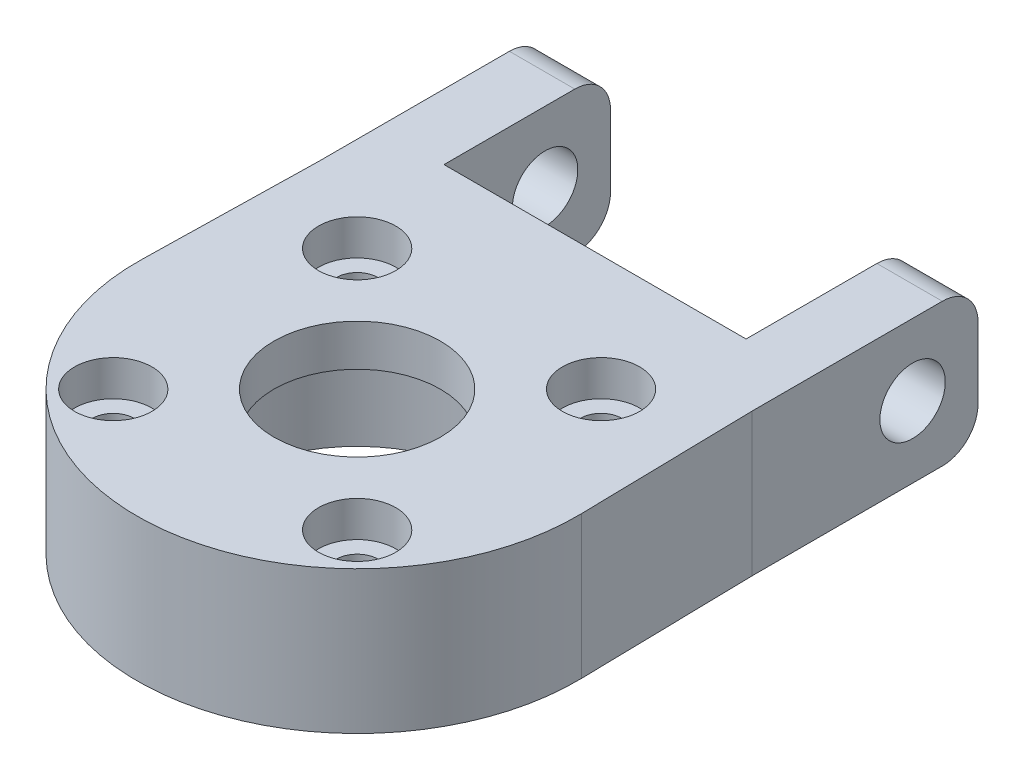
ISO-10303-21;
HEADER;
FILE_DESCRIPTION(('STEP AP214'),'2;1');
FILE_NAME('part.step','',(''),(''),'','','');
FILE_SCHEMA(('AUTOMOTIVE_DESIGN { 1 0 10303 214 1 1 1 1 }'));
ENDSEC;
DATA;
#1=APPLICATION_CONTEXT('core data for automotive mechanical design processes');
#2=APPLICATION_PROTOCOL_DEFINITION('international standard','automotive_design',2000,#1);
#3=PRODUCT_CONTEXT('',#1,'mechanical');
#4=PRODUCT('Part','Part','',(#3));
#5=PRODUCT_RELATED_PRODUCT_CATEGORY('part','',(#4));
#6=PRODUCT_DEFINITION_FORMATION('','',#4);
#7=PRODUCT_DEFINITION_CONTEXT('part definition',#1,'design');
#8=PRODUCT_DEFINITION('design','',#6,#7);
#9=PRODUCT_DEFINITION_SHAPE('','',#8);
#10=(LENGTH_UNIT() NAMED_UNIT(*) SI_UNIT(.MILLI.,.METRE.));
#11=(NAMED_UNIT(*) PLANE_ANGLE_UNIT() SI_UNIT($,.RADIAN.));
#12=(NAMED_UNIT(*) SI_UNIT($,.STERADIAN.) SOLID_ANGLE_UNIT());
#13=UNCERTAINTY_MEASURE_WITH_UNIT(LENGTH_MEASURE(1.E-05),#10,'distance_accuracy_value','');
#14=(GEOMETRIC_REPRESENTATION_CONTEXT(3) GLOBAL_UNCERTAINTY_ASSIGNED_CONTEXT((#13)) GLOBAL_UNIT_ASSIGNED_CONTEXT((#10,
#11,#12)) REPRESENTATION_CONTEXT('',''));
#15=CARTESIAN_POINT('',(0.,0.,0.));
#16=DIRECTION('',(0.,0.,1.));
#17=DIRECTION('',(1.,0.,0.));
#18=AXIS2_PLACEMENT_3D('',#15,#16,#17);
#19=CARTESIAN_POINT('',(-18.2,12.,-20.));
#20=DIRECTION('',(0.,0.,1.));
#21=DIRECTION('',(1.,0.,0.));
#22=AXIS2_PLACEMENT_3D('',#19,#20,#21);
#23=PLANE('',#22);
#24=DIRECTION('',(0.,-1.,0.));
#25=VECTOR('',#24,1.);
#26=CARTESIAN_POINT('',(-12.7,0.,-20.));
#27=LINE('',#26,#25);
#28=CARTESIAN_POINT('',(-12.7,12.,-20.));
#29=VERTEX_POINT('',#28);
#30=CARTESIAN_POINT('',(-12.7,0.,-20.));
#31=VERTEX_POINT('',#30);
#32=EDGE_CURVE('E137',#29,#31,#27,.T.);
#33=ORIENTED_EDGE('',*,*,#32,.F.);
#34=DIRECTION('',(-1.,0.,0.));
#35=VECTOR('',#34,1.);
#36=CARTESIAN_POINT('',(-18.2,12.,-20.));
#37=LINE('',#36,#35);
#38=CARTESIAN_POINT('',(12.7,12.,-20.));
#39=VERTEX_POINT('',#38);
#40=EDGE_CURVE('E147',#39,#29,#37,.T.);
#41=ORIENTED_EDGE('',*,*,#40,.F.);
#42=DIRECTION('',(0.,1.,0.));
#43=VECTOR('',#42,1.);
#44=CARTESIAN_POINT('',(12.7,0.,-20.));
#45=LINE('',#44,#43);
#46=CARTESIAN_POINT('',(12.7,0.,-20.));
#47=VERTEX_POINT('',#46);
#48=EDGE_CURVE('E141',#47,#39,#45,.T.);
#49=ORIENTED_EDGE('',*,*,#48,.F.);
#50=DIRECTION('',(-1.,0.,0.));
#51=VECTOR('',#50,1.);
#52=CARTESIAN_POINT('',(-18.2,0.,-20.));
#53=LINE('',#52,#51);
#54=EDGE_CURVE('E150',#47,#31,#53,.T.);
#55=ORIENTED_EDGE('',*,*,#54,.T.);
#56=EDGE_LOOP('',(#33,#41,#49,#55));
#57=FACE_BOUND('',#56,.T.);
#58=ADVANCED_FACE('F32',(#57),#23,.F.);
#59=CARTESIAN_POINT('',(10.2530483272049,12.,10.253048327205));
#60=DIRECTION('',(0.,-1.,0.));
#61=DIRECTION('',(0.,0.,-1.));
#62=AXIS2_PLACEMENT_3D('',#59,#60,#61);
#63=CYLINDRICAL_SURFACE('',#62,1.75);
#64=CARTESIAN_POINT('',(10.2530483272049,0.,10.253048327205));
#65=DIRECTION('',(0.,-1.,0.));
#66=DIRECTION('',(0.,0.,-1.));
#67=AXIS2_PLACEMENT_3D('',#64,#65,#66);
#68=CIRCLE('',#67,1.75);
#69=CARTESIAN_POINT('',(10.2530483272049,0.,8.50304832720495));
#70=VERTEX_POINT('',#69);
#71=EDGE_CURVE('E306',#70,#70,#68,.T.);
#72=ORIENTED_EDGE('',*,*,#71,.T.);
#73=EDGE_LOOP('',(#72));
#74=FACE_BOUND('',#73,.T.);
#75=CARTESIAN_POINT('',(10.2530483272049,9.,10.253048327205));
#76=DIRECTION('',(0.,1.,0.));
#77=DIRECTION('',(0.,0.,1.));
#78=AXIS2_PLACEMENT_3D('',#75,#76,#77);
#79=CIRCLE('',#78,1.75);
#80=CARTESIAN_POINT('',(10.2530483272049,9.,12.003048327205));
#81=VERTEX_POINT('',#80);
#82=EDGE_CURVE('E213',#81,#81,#79,.F.);
#83=ORIENTED_EDGE('',*,*,#82,.F.);
#84=EDGE_LOOP('',(#83));
#85=FACE_BOUND('',#84,.T.);
#86=ADVANCED_FACE('F362',(#74,#85),#63,.F.);
#87=CARTESIAN_POINT('',(-10.253048327205,12.,10.2530483272044));
#88=DIRECTION('',(0.,-1.,0.));
#89=DIRECTION('',(0.,0.,-1.));
#90=AXIS2_PLACEMENT_3D('',#87,#88,#89);
#91=CYLINDRICAL_SURFACE('',#90,1.75000000000061);
#92=CARTESIAN_POINT('',(-10.253048327205,0.,10.2530483272044));
#93=DIRECTION('',(0.,-1.,0.));
#94=DIRECTION('',(0.,0.,-1.));
#95=AXIS2_PLACEMENT_3D('',#92,#93,#94);
#96=CIRCLE('',#95,1.75000000000061);
#97=CARTESIAN_POINT('',(-10.253048327205,0.,8.50304832720374));
#98=VERTEX_POINT('',#97);
#99=EDGE_CURVE('E204',#98,#98,#96,.T.);
#100=ORIENTED_EDGE('',*,*,#99,.T.);
#101=EDGE_LOOP('',(#100));
#102=FACE_BOUND('',#101,.T.);
#103=CARTESIAN_POINT('',(-10.253048327205,9.,10.2530483272044));
#104=DIRECTION('',(0.,1.,0.));
#105=DIRECTION('',(0.,0.,1.));
#106=AXIS2_PLACEMENT_3D('',#103,#104,#105);
#107=CIRCLE('',#106,1.75000000000061);
#108=CARTESIAN_POINT('',(-10.253048327205,9.,12.003048327205));
#109=VERTEX_POINT('',#108);
#110=EDGE_CURVE('E209',#109,#109,#107,.F.);
#111=ORIENTED_EDGE('',*,*,#110,.F.);
#112=EDGE_LOOP('',(#111));
#113=FACE_BOUND('',#112,.T.);
#114=ADVANCED_FACE('F367',(#102,#113),#91,.F.);
#115=CARTESIAN_POINT('',(10.2530483272055,12.,-10.2530483272049));
#116=DIRECTION('',(0.,-1.,0.));
#117=DIRECTION('',(0.,0.,-1.));
#118=AXIS2_PLACEMENT_3D('',#115,#116,#117);
#119=CYLINDRICAL_SURFACE('',#118,1.74999999999986);
#120=CARTESIAN_POINT('',(10.2530483272055,0.,-10.2530483272049));
#121=DIRECTION('',(0.,-1.,0.));
#122=DIRECTION('',(0.,0.,-1.));
#123=AXIS2_PLACEMENT_3D('',#120,#121,#122);
#124=CIRCLE('',#123,1.74999999999986);
#125=CARTESIAN_POINT('',(10.2530483272055,0.,-12.0030483272048));
#126=VERTEX_POINT('',#125);
#127=EDGE_CURVE('E303',#126,#126,#124,.T.);
#128=ORIENTED_EDGE('',*,*,#127,.T.);
#129=EDGE_LOOP('',(#128));
#130=FACE_BOUND('',#129,.T.);
#131=CARTESIAN_POINT('',(10.2530483272055,9.,-10.2530483272049));
#132=DIRECTION('',(0.,1.,0.));
#133=DIRECTION('',(0.,0.,1.));
#134=AXIS2_PLACEMENT_3D('',#131,#132,#133);
#135=CIRCLE('',#134,1.74999999999986);
#136=CARTESIAN_POINT('',(10.2530483272055,9.,-8.50304832720506));
#137=VERTEX_POINT('',#136);
#138=EDGE_CURVE('E206',#137,#137,#135,.F.);
#139=ORIENTED_EDGE('',*,*,#138,.F.);
#140=EDGE_LOOP('',(#139));
#141=FACE_BOUND('',#140,.T.);
#142=ADVANCED_FACE('F438',(#130,#141),#119,.F.);
#143=CARTESIAN_POINT('',(-10.2530483272044,12.,-10.2530483272055));
#144=DIRECTION('',(0.,-1.,0.));
#145=DIRECTION('',(0.,0.,-1.));
#146=AXIS2_PLACEMENT_3D('',#143,#144,#145);
#147=CYLINDRICAL_SURFACE('',#146,1.75000000000042);
#148=CARTESIAN_POINT('',(-10.2530483272044,0.,-10.2530483272055));
#149=DIRECTION('',(0.,-1.,0.));
#150=DIRECTION('',(0.,0.,-1.));
#151=AXIS2_PLACEMENT_3D('',#148,#149,#150);
#152=CIRCLE('',#151,1.75000000000042);
#153=CARTESIAN_POINT('',(-10.2530483272044,0.,-12.0030483272059));
#154=VERTEX_POINT('',#153);
#155=EDGE_CURVE('E307',#154,#154,#152,.T.);
#156=ORIENTED_EDGE('',*,*,#155,.T.);
#157=EDGE_LOOP('',(#156));
#158=FACE_BOUND('',#157,.T.);
#159=CARTESIAN_POINT('',(-10.2530483272044,9.,-10.2530483272055));
#160=DIRECTION('',(0.,1.,0.));
#161=DIRECTION('',(0.,0.,1.));
#162=AXIS2_PLACEMENT_3D('',#159,#160,#161);
#163=CIRCLE('',#162,1.75000000000042);
#164=CARTESIAN_POINT('',(-10.2530483272044,9.,-8.50304832720511));
#165=VERTEX_POINT('',#164);
#166=EDGE_CURVE('E201',#165,#165,#163,.F.);
#167=ORIENTED_EDGE('',*,*,#166,.F.);
#168=EDGE_LOOP('',(#167));
#169=FACE_BOUND('',#168,.T.);
#170=ADVANCED_FACE('F441',(#158,#169),#147,.F.);
#171=CARTESIAN_POINT('',(0.,12.,0.));
#172=DIRECTION('',(0.,-1.,0.));
#173=DIRECTION('',(0.,0.,-1.));
#174=AXIS2_PLACEMENT_3D('',#171,#172,#173);
#175=CYLINDRICAL_SURFACE('',#174,7.);
#176=CARTESIAN_POINT('',(0.,12.,0.));
#177=DIRECTION('',(0.,1.,0.));
#178=DIRECTION('',(0.,0.,1.));
#179=AXIS2_PLACEMENT_3D('',#176,#177,#178);
#180=CIRCLE('',#179,7.);
#181=CARTESIAN_POINT('',(0.,12.,7.));
#182=VERTEX_POINT('',#181);
#183=EDGE_CURVE('E174',#182,#182,#180,.T.);
#184=ORIENTED_EDGE('',*,*,#183,.T.);
#185=EDGE_LOOP('',(#184));
#186=FACE_BOUND('',#185,.T.);
#187=CARTESIAN_POINT('',(0.,8.5,0.));
#188=DIRECTION('',(0.,-1.,0.));
#189=DIRECTION('',(0.,0.,-1.));
#190=AXIS2_PLACEMENT_3D('',#187,#188,#189);
#191=CIRCLE('',#190,7.);
#192=CARTESIAN_POINT('',(0.,8.5,-7.));
#193=VERTEX_POINT('',#192);
#194=EDGE_CURVE('E197',#193,#193,#191,.T.);
#195=ORIENTED_EDGE('',*,*,#194,.T.);
#196=EDGE_LOOP('',(#195));
#197=FACE_BOUND('',#196,.T.);
#198=ADVANCED_FACE('F445',(#186,#197),#175,.F.);
#199=CARTESIAN_POINT('',(0.,12.,0.));
#200=DIRECTION('',(0.,1.,0.));
#201=DIRECTION('',(0.,0.,1.));
#202=AXIS2_PLACEMENT_3D('',#199,#200,#201);
#203=PLANE('',#202);
#204=CARTESIAN_POINT('',(10.2530483272055,12.,-10.2530483272049));
#205=DIRECTION('',(0.,1.,0.));
#206=DIRECTION('',(0.,0.,1.));
#207=AXIS2_PLACEMENT_3D('',#204,#205,#206);
#208=CIRCLE('',#207,3.25);
#209=CARTESIAN_POINT('',(10.2530483272055,12.,-7.00304832720494));
#210=VERTEX_POINT('',#209);
#211=EDGE_CURVE('E285',#210,#210,#208,.T.);
#212=ORIENTED_EDGE('',*,*,#211,.F.);
#213=EDGE_LOOP('',(#212));
#214=FACE_BOUND('',#213,.T.);
#215=CARTESIAN_POINT('',(10.2530483272049,12.,10.2530483272049));
#216=DIRECTION('',(0.,1.,0.));
#217=DIRECTION('',(0.,0.,1.));
#218=AXIS2_PLACEMENT_3D('',#215,#216,#217);
#219=CIRCLE('',#218,3.25);
#220=CARTESIAN_POINT('',(10.2530483272049,12.,13.5030483272049));
#221=VERTEX_POINT('',#220);
#222=EDGE_CURVE('E291',#221,#221,#219,.T.);
#223=ORIENTED_EDGE('',*,*,#222,.F.);
#224=EDGE_LOOP('',(#223));
#225=FACE_BOUND('',#224,.T.);
#226=CARTESIAN_POINT('',(-10.2530483272049,12.,10.2530483272044));
#227=DIRECTION('',(0.,1.,0.));
#228=DIRECTION('',(0.,0.,1.));
#229=AXIS2_PLACEMENT_3D('',#226,#227,#228);
#230=CIRCLE('',#229,3.25);
#231=CARTESIAN_POINT('',(-10.2530483272049,12.,13.5030483272044));
#232=VERTEX_POINT('',#231);
#233=EDGE_CURVE('E282',#232,#232,#230,.T.);
#234=ORIENTED_EDGE('',*,*,#233,.F.);
#235=EDGE_LOOP('',(#234));
#236=FACE_BOUND('',#235,.T.);
#237=CARTESIAN_POINT('',(-10.2530483272044,12.,-10.2530483272055));
#238=DIRECTION('',(0.,1.,0.));
#239=DIRECTION('',(0.,0.,1.));
#240=AXIS2_PLACEMENT_3D('',#237,#238,#239);
#241=CIRCLE('',#240,3.25);
#242=CARTESIAN_POINT('',(-10.2530483272044,12.,-7.00304832720552));
#243=VERTEX_POINT('',#242);
#244=EDGE_CURVE('E216',#243,#243,#241,.T.);
#245=ORIENTED_EDGE('',*,*,#244,.F.);
#246=EDGE_LOOP('',(#245));
#247=FACE_BOUND('',#246,.T.);
#248=DIRECTION('',(0.,0.,-1.));
#249=VECTOR('',#248,1.);
#250=CARTESIAN_POINT('',(18.2,12.,-20.));
#251=LINE('',#250,#249);
#252=CARTESIAN_POINT('',(18.2,12.,-15.));
#253=VERTEX_POINT('',#252);
#254=CARTESIAN_POINT('',(18.2,12.,-31.));
#255=VERTEX_POINT('',#254);
#256=EDGE_CURVE('E160',#253,#255,#251,.T.);
#257=ORIENTED_EDGE('',*,*,#256,.T.);
#258=DIRECTION('',(1.,0.,0.));
#259=VECTOR('',#258,1.);
#260=CARTESIAN_POINT('',(12.7,12.,-31.));
#261=LINE('',#260,#259);
#262=CARTESIAN_POINT('',(12.7,12.,-31.));
#263=VERTEX_POINT('',#262);
#264=EDGE_CURVE('E241',#255,#263,#261,.F.);
#265=ORIENTED_EDGE('',*,*,#264,.T.);
#266=DIRECTION('',(0.,0.,1.));
#267=VECTOR('',#266,1.);
#268=CARTESIAN_POINT('',(12.7,12.,-34.));
#269=LINE('',#268,#267);
#270=EDGE_CURVE('E158',#263,#39,#269,.T.);
#271=ORIENTED_EDGE('',*,*,#270,.T.);
#272=ORIENTED_EDGE('',*,*,#40,.T.);
#273=DIRECTION('',(0.,0.,1.));
#274=VECTOR('',#273,1.);
#275=CARTESIAN_POINT('',(-12.7,12.,-34.));
#276=LINE('',#275,#274);
#277=CARTESIAN_POINT('',(-12.7,12.,-31.));
#278=VERTEX_POINT('',#277);
#279=EDGE_CURVE('E134',#278,#29,#276,.T.);
#280=ORIENTED_EDGE('',*,*,#279,.F.);
#281=DIRECTION('',(1.,0.,0.));
#282=VECTOR('',#281,1.);
#283=CARTESIAN_POINT('',(-18.2,12.,-31.));
#284=LINE('',#283,#282);
#285=CARTESIAN_POINT('',(-18.2,12.,-31.));
#286=VERTEX_POINT('',#285);
#287=EDGE_CURVE('E239',#278,#286,#284,.F.);
#288=ORIENTED_EDGE('',*,*,#287,.T.);
#289=DIRECTION('',(0.,0.,1.));
#290=VECTOR('',#289,1.);
#291=CARTESIAN_POINT('',(-18.2,12.,-15.));
#292=LINE('',#291,#290);
#293=CARTESIAN_POINT('',(-18.2,12.,-15.));
#294=VERTEX_POINT('',#293);
#295=EDGE_CURVE('E159',#286,#294,#292,.T.);
#296=ORIENTED_EDGE('',*,*,#295,.T.);
#297=DIRECTION('',(-0.0202487664444169,0.,0.999794972710645));
#298=VECTOR('',#297,1.);
#299=CARTESIAN_POINT('',(-18.2,12.,-15.));
#300=LINE('',#299,#298);
#301=CARTESIAN_POINT('',(-18.4962069951469,12.,-0.37460217922172));
#302=VERTEX_POINT('',#301);
#303=EDGE_CURVE('E162',#294,#302,#300,.T.);
#304=ORIENTED_EDGE('',*,*,#303,.T.);
#305=CARTESIAN_POINT('',(0.,12.,0.));
#306=DIRECTION('',(0.,1.,0.));
#307=DIRECTION('',(0.,0.,1.));
#308=AXIS2_PLACEMENT_3D('',#305,#306,#307);
#309=CIRCLE('',#308,18.5);
#310=CARTESIAN_POINT('',(18.4962069951469,12.,-0.37460217922172));
#311=VERTEX_POINT('',#310);
#312=EDGE_CURVE('E184',#302,#311,#309,.T.);
#313=ORIENTED_EDGE('',*,*,#312,.T.);
#314=DIRECTION('',(-0.0202487664444169,0.,-0.999794972710645));
#315=VECTOR('',#314,1.);
#316=CARTESIAN_POINT('',(18.2,12.,-15.));
#317=LINE('',#316,#315);
#318=EDGE_CURVE('E164',#311,#253,#317,.T.);
#319=ORIENTED_EDGE('',*,*,#318,.T.);
#320=EDGE_LOOP('',(#257,#265,#271,#272,#280,#288,#296,#304,#313,#319));
#321=FACE_BOUND('',#320,.T.);
#322=ORIENTED_EDGE('',*,*,#183,.F.);
#323=EDGE_LOOP('',(#322));
#324=FACE_BOUND('',#323,.T.);
#325=ADVANCED_FACE('F155',(#214,#225,#236,#247,#321,#324),#203,.T.);
#326=CARTESIAN_POINT('',(0.,0.,0.));
#327=DIRECTION('',(0.,1.,0.));
#328=DIRECTION('',(0.,0.,1.));
#329=AXIS2_PLACEMENT_3D('',#326,#327,#328);
#330=PLANE('',#329);
#331=ORIENTED_EDGE('',*,*,#127,.F.);
#332=EDGE_LOOP('',(#331));
#333=FACE_BOUND('',#332,.T.);
#334=ORIENTED_EDGE('',*,*,#155,.F.);
#335=EDGE_LOOP('',(#334));
#336=FACE_BOUND('',#335,.T.);
#337=ORIENTED_EDGE('',*,*,#99,.F.);
#338=EDGE_LOOP('',(#337));
#339=FACE_BOUND('',#338,.T.);
#340=ORIENTED_EDGE('',*,*,#71,.F.);
#341=EDGE_LOOP('',(#340));
#342=FACE_BOUND('',#341,.T.);
#343=CARTESIAN_POINT('',(0.,0.,0.));
#344=DIRECTION('',(0.,-1.,0.));
#345=DIRECTION('',(0.,0.,-1.));
#346=AXIS2_PLACEMENT_3D('',#343,#344,#345);
#347=CIRCLE('',#346,11.075);
#348=CARTESIAN_POINT('',(0.,0.,-11.075));
#349=VERTEX_POINT('',#348);
#350=EDGE_CURVE('E314',#349,#349,#347,.T.);
#351=ORIENTED_EDGE('',*,*,#350,.F.);
#352=EDGE_LOOP('',(#351));
#353=FACE_BOUND('',#352,.T.);
#354=DIRECTION('',(0.,0.,1.));
#355=VECTOR('',#354,1.);
#356=CARTESIAN_POINT('',(12.7,0.,-34.));
#357=LINE('',#356,#355);
#358=CARTESIAN_POINT('',(12.7,0.,-31.));
#359=VERTEX_POINT('',#358);
#360=EDGE_CURVE('E280',#359,#47,#357,.T.);
#361=ORIENTED_EDGE('',*,*,#360,.F.);
#362=DIRECTION('',(-1.,0.,0.));
#363=VECTOR('',#362,1.);
#364=CARTESIAN_POINT('',(0.,0.,-31.));
#365=LINE('',#364,#363);
#366=CARTESIAN_POINT('',(18.2,0.,-31.));
#367=VERTEX_POINT('',#366);
#368=EDGE_CURVE('E233',#359,#367,#365,.F.);
#369=ORIENTED_EDGE('',*,*,#368,.T.);
#370=DIRECTION('',(0.,0.,-1.));
#371=VECTOR('',#370,1.);
#372=CARTESIAN_POINT('',(18.2,0.,-20.));
#373=LINE('',#372,#371);
#374=CARTESIAN_POINT('',(18.2,0.,-15.));
#375=VERTEX_POINT('',#374);
#376=EDGE_CURVE('E176',#375,#367,#373,.T.);
#377=ORIENTED_EDGE('',*,*,#376,.F.);
#378=DIRECTION('',(-0.0202487664444169,0.,-0.999794972710645));
#379=VECTOR('',#378,1.);
#380=CARTESIAN_POINT('',(18.2,0.,-15.));
#381=LINE('',#380,#379);
#382=CARTESIAN_POINT('',(18.4962069951469,0.,-0.37460217922172));
#383=VERTEX_POINT('',#382);
#384=EDGE_CURVE('E173',#383,#375,#381,.T.);
#385=ORIENTED_EDGE('',*,*,#384,.F.);
#386=CARTESIAN_POINT('',(0.,0.,0.));
#387=DIRECTION('',(0.,1.,0.));
#388=DIRECTION('',(0.,0.,1.));
#389=AXIS2_PLACEMENT_3D('',#386,#387,#388);
#390=CIRCLE('',#389,18.5);
#391=CARTESIAN_POINT('',(-18.4962069951469,0.,-0.37460217922172));
#392=VERTEX_POINT('',#391);
#393=EDGE_CURVE('E170',#392,#383,#390,.T.);
#394=ORIENTED_EDGE('',*,*,#393,.F.);
#395=DIRECTION('',(-0.0202487664444169,0.,0.999794972710645));
#396=VECTOR('',#395,1.);
#397=CARTESIAN_POINT('',(-18.2,0.,-15.));
#398=LINE('',#397,#396);
#399=CARTESIAN_POINT('',(-18.2,0.,-15.));
#400=VERTEX_POINT('',#399);
#401=EDGE_CURVE('E182',#400,#392,#398,.T.);
#402=ORIENTED_EDGE('',*,*,#401,.F.);
#403=DIRECTION('',(0.,0.,1.));
#404=VECTOR('',#403,1.);
#405=CARTESIAN_POINT('',(-18.2,0.,-15.));
#406=LINE('',#405,#404);
#407=CARTESIAN_POINT('',(-18.2,0.,-31.));
#408=VERTEX_POINT('',#407);
#409=EDGE_CURVE('E180',#408,#400,#406,.T.);
#410=ORIENTED_EDGE('',*,*,#409,.F.);
#411=DIRECTION('',(-1.,0.,0.));
#412=VECTOR('',#411,1.);
#413=CARTESIAN_POINT('',(0.,0.,-31.));
#414=LINE('',#413,#412);
#415=CARTESIAN_POINT('',(-12.7,0.,-31.));
#416=VERTEX_POINT('',#415);
#417=EDGE_CURVE('E231',#408,#416,#414,.F.);
#418=ORIENTED_EDGE('',*,*,#417,.T.);
#419=DIRECTION('',(0.,0.,1.));
#420=VECTOR('',#419,1.);
#421=CARTESIAN_POINT('',(-12.7,0.,-34.));
#422=LINE('',#421,#420);
#423=EDGE_CURVE('E142',#416,#31,#422,.T.);
#424=ORIENTED_EDGE('',*,*,#423,.T.);
#425=ORIENTED_EDGE('',*,*,#54,.F.);
#426=EDGE_LOOP('',(#361,#369,#377,#385,#394,#402,#410,#418,#424,#425));
#427=FACE_BOUND('',#426,.T.);
#428=ADVANCED_FACE('F262',(#333,#336,#339,#342,#353,#427),#330,.F.);
#429=CARTESIAN_POINT('',(0.,12.,0.));
#430=DIRECTION('',(0.,-1.,0.));
#431=DIRECTION('',(0.,0.,-1.));
#432=AXIS2_PLACEMENT_3D('',#429,#430,#431);
#433=CYLINDRICAL_SURFACE('',#432,18.5);
#434=ORIENTED_EDGE('',*,*,#393,.T.);
#435=DIRECTION('',(0.,-1.,0.));
#436=VECTOR('',#435,1.);
#437=CARTESIAN_POINT('',(18.4962069951469,12.,-0.37460217922172));
#438=LINE('',#437,#436);
#439=EDGE_CURVE('E193',#311,#383,#438,.T.);
#440=ORIENTED_EDGE('',*,*,#439,.F.);
#441=ORIENTED_EDGE('',*,*,#312,.F.);
#442=DIRECTION('',(0.,-1.,0.));
#443=VECTOR('',#442,1.);
#444=CARTESIAN_POINT('',(-18.4962069951469,12.,-0.37460217922172));
#445=LINE('',#444,#443);
#446=EDGE_CURVE('E169',#302,#392,#445,.T.);
#447=ORIENTED_EDGE('',*,*,#446,.T.);
#448=EDGE_LOOP('',(#434,#440,#441,#447));
#449=FACE_BOUND('',#448,.T.);
#450=ADVANCED_FACE('F348',(#449),#433,.T.);
#451=CARTESIAN_POINT('',(18.2,12.,-15.));
#452=DIRECTION('',(-0.999794972710645,0.,0.0202487664444169));
#453=DIRECTION('',(0.020248766444417,0.,0.999794972710645));
#454=AXIS2_PLACEMENT_3D('',#451,#452,#453);
#455=PLANE('',#454);
#456=ORIENTED_EDGE('',*,*,#384,.T.);
#457=DIRECTION('',(0.,-1.,0.));
#458=VECTOR('',#457,1.);
#459=CARTESIAN_POINT('',(18.2,12.,-15.));
#460=LINE('',#459,#458);
#461=EDGE_CURVE('E190',#253,#375,#460,.T.);
#462=ORIENTED_EDGE('',*,*,#461,.F.);
#463=ORIENTED_EDGE('',*,*,#318,.F.);
#464=ORIENTED_EDGE('',*,*,#439,.T.);
#465=EDGE_LOOP('',(#456,#462,#463,#464));
#466=FACE_BOUND('',#465,.T.);
#467=ADVANCED_FACE('F328',(#466),#455,.F.);
#468=CARTESIAN_POINT('',(18.2,12.,-20.));
#469=DIRECTION('',(-1.,0.,0.));
#470=DIRECTION('',(0.,0.,1.));
#471=AXIS2_PLACEMENT_3D('',#468,#469,#470);
#472=PLANE('',#471);
#473=CARTESIAN_POINT('',(18.2,6.,-28.5011378539082));
#474=DIRECTION('',(-1.,0.,0.));
#475=DIRECTION('',(0.,0.,1.));
#476=AXIS2_PLACEMENT_3D('',#473,#474,#475);
#477=CIRCLE('',#476,2.75);
#478=CARTESIAN_POINT('',(18.2,6.,-25.7511378539082));
#479=VERTEX_POINT('',#478);
#480=EDGE_CURVE('E152',#479,#479,#477,.T.);
#481=ORIENTED_EDGE('',*,*,#480,.T.);
#482=EDGE_LOOP('',(#481));
#483=FACE_BOUND('',#482,.T.);
#484=ORIENTED_EDGE('',*,*,#376,.T.);
#485=CARTESIAN_POINT('',(18.2,3.,-31.));
#486=DIRECTION('',(-1.,0.,0.));
#487=DIRECTION('',(0.,0.,1.));
#488=AXIS2_PLACEMENT_3D('',#485,#486,#487);
#489=CIRCLE('',#488,3.);
#490=CARTESIAN_POINT('',(18.2,3.,-34.));
#491=VERTEX_POINT('',#490);
#492=EDGE_CURVE('E237',#367,#491,#489,.F.);
#493=ORIENTED_EDGE('',*,*,#492,.T.);
#494=DIRECTION('',(0.,-1.,0.));
#495=VECTOR('',#494,1.);
#496=CARTESIAN_POINT('',(18.2,0.,-34.));
#497=LINE('',#496,#495);
#498=CARTESIAN_POINT('',(18.2,9.,-34.));
#499=VERTEX_POINT('',#498);
#500=EDGE_CURVE('E272',#499,#491,#497,.T.);
#501=ORIENTED_EDGE('',*,*,#500,.F.);
#502=CARTESIAN_POINT('',(18.2,9.,-31.));
#503=DIRECTION('',(-1.,0.,0.));
#504=DIRECTION('',(0.,0.,1.));
#505=AXIS2_PLACEMENT_3D('',#502,#503,#504);
#506=CIRCLE('',#505,3.);
#507=EDGE_CURVE('E235',#499,#255,#506,.F.);
#508=ORIENTED_EDGE('',*,*,#507,.T.);
#509=ORIENTED_EDGE('',*,*,#256,.F.);
#510=ORIENTED_EDGE('',*,*,#461,.T.);
#511=EDGE_LOOP('',(#484,#493,#501,#508,#509,#510));
#512=FACE_BOUND('',#511,.T.);
#513=ADVANCED_FACE('F331',(#483,#512),#472,.F.);
#514=CARTESIAN_POINT('',(-18.2,12.,-15.));
#515=DIRECTION('',(1.,0.,0.));
#516=DIRECTION('',(0.,0.,-1.));
#517=AXIS2_PLACEMENT_3D('',#514,#515,#516);
#518=PLANE('',#517);
#519=CARTESIAN_POINT('',(-18.2,6.,-28.5011378539082));
#520=DIRECTION('',(-1.,0.,0.));
#521=DIRECTION('',(0.,0.,1.));
#522=AXIS2_PLACEMENT_3D('',#519,#520,#521);
#523=CIRCLE('',#522,2.75);
#524=CARTESIAN_POINT('',(-18.2,6.,-25.7511378539082));
#525=VERTEX_POINT('',#524);
#526=EDGE_CURVE('E221',#525,#525,#523,.T.);
#527=ORIENTED_EDGE('',*,*,#526,.F.);
#528=EDGE_LOOP('',(#527));
#529=FACE_BOUND('',#528,.T.);
#530=ORIENTED_EDGE('',*,*,#295,.F.);
#531=CARTESIAN_POINT('',(-18.2,9.,-31.));
#532=DIRECTION('',(1.,0.,0.));
#533=DIRECTION('',(0.,0.,-1.));
#534=AXIS2_PLACEMENT_3D('',#531,#532,#533);
#535=CIRCLE('',#534,3.);
#536=CARTESIAN_POINT('',(-18.2,9.,-34.));
#537=VERTEX_POINT('',#536);
#538=EDGE_CURVE('E11',#286,#537,#535,.F.);
#539=ORIENTED_EDGE('',*,*,#538,.T.);
#540=DIRECTION('',(0.,1.,0.));
#541=VECTOR('',#540,1.);
#542=CARTESIAN_POINT('',(-18.2,0.,-34.));
#543=LINE('',#542,#541);
#544=CARTESIAN_POINT('',(-18.2,3.,-34.));
#545=VERTEX_POINT('',#544);
#546=EDGE_CURVE('E151',#545,#537,#543,.T.);
#547=ORIENTED_EDGE('',*,*,#546,.F.);
#548=CARTESIAN_POINT('',(-18.2,3.,-31.));
#549=DIRECTION('',(1.,0.,0.));
#550=DIRECTION('',(0.,0.,-1.));
#551=AXIS2_PLACEMENT_3D('',#548,#549,#550);
#552=CIRCLE('',#551,3.);
#553=EDGE_CURVE('E40',#545,#408,#552,.F.);
#554=ORIENTED_EDGE('',*,*,#553,.T.);
#555=ORIENTED_EDGE('',*,*,#409,.T.);
#556=DIRECTION('',(0.,-1.,0.));
#557=VECTOR('',#556,1.);
#558=CARTESIAN_POINT('',(-18.2,12.,-15.));
#559=LINE('',#558,#557);
#560=EDGE_CURVE('E187',#294,#400,#559,.T.);
#561=ORIENTED_EDGE('',*,*,#560,.F.);
#562=EDGE_LOOP('',(#530,#539,#547,#554,#555,#561));
#563=FACE_BOUND('',#562,.T.);
#564=ADVANCED_FACE('F253',(#529,#563),#518,.F.);
#565=CARTESIAN_POINT('',(-18.2,12.,-15.));
#566=DIRECTION('',(0.999794972710645,0.,0.0202487664444169));
#567=DIRECTION('',(0.020248766444417,0.,-0.999794972710645));
#568=AXIS2_PLACEMENT_3D('',#565,#566,#567);
#569=PLANE('',#568);
#570=ORIENTED_EDGE('',*,*,#401,.T.);
#571=ORIENTED_EDGE('',*,*,#446,.F.);
#572=ORIENTED_EDGE('',*,*,#303,.F.);
#573=ORIENTED_EDGE('',*,*,#560,.T.);
#574=EDGE_LOOP('',(#570,#571,#572,#573));
#575=FACE_BOUND('',#574,.T.);
#576=ADVANCED_FACE('F352',(#575),#569,.F.);
#577=CARTESIAN_POINT('',(0.,8.5,0.));
#578=DIRECTION('',(0.,-1.,0.));
#579=DIRECTION('',(0.,0.,-1.));
#580=AXIS2_PLACEMENT_3D('',#577,#578,#579);
#581=CYLINDRICAL_SURFACE('',#580,11.075);
#582=CARTESIAN_POINT('',(0.,8.5,0.));
#583=DIRECTION('',(0.,-1.,0.));
#584=DIRECTION('',(0.,0.,-1.));
#585=AXIS2_PLACEMENT_3D('',#582,#583,#584);
#586=CIRCLE('',#585,11.075);
#587=CARTESIAN_POINT('',(0.,8.5,-11.075));
#588=VERTEX_POINT('',#587);
#589=EDGE_CURVE('E200',#588,#588,#586,.T.);
#590=ORIENTED_EDGE('',*,*,#589,.F.);
#591=EDGE_LOOP('',(#590));
#592=FACE_BOUND('',#591,.T.);
#593=ORIENTED_EDGE('',*,*,#350,.T.);
#594=EDGE_LOOP('',(#593));
#595=FACE_BOUND('',#594,.T.);
#596=ADVANCED_FACE('F452',(#592,#595),#581,.F.);
#597=CARTESIAN_POINT('',(0.,8.5,0.));
#598=DIRECTION('',(0.,-1.,0.));
#599=DIRECTION('',(0.,0.,-1.));
#600=AXIS2_PLACEMENT_3D('',#597,#598,#599);
#601=PLANE('',#600);
#602=ORIENTED_EDGE('',*,*,#194,.F.);
#603=EDGE_LOOP('',(#602));
#604=FACE_BOUND('',#603,.T.);
#605=ORIENTED_EDGE('',*,*,#589,.T.);
#606=EDGE_LOOP('',(#605));
#607=FACE_BOUND('',#606,.T.);
#608=ADVANCED_FACE('F433',(#604,#607),#601,.T.);
#609=CARTESIAN_POINT('',(-10.2530483272044,9.,-10.2530483272055));
#610=DIRECTION('',(0.,1.,0.));
#611=DIRECTION('',(0.,0.,1.));
#612=AXIS2_PLACEMENT_3D('',#609,#610,#611);
#613=PLANE('',#612);
#614=CARTESIAN_POINT('',(-10.2530483272044,9.,-10.2530483272055));
#615=DIRECTION('',(0.,1.,0.));
#616=DIRECTION('',(0.,0.,1.));
#617=AXIS2_PLACEMENT_3D('',#614,#615,#616);
#618=CIRCLE('',#617,3.25);
#619=CARTESIAN_POINT('',(-10.2530483272044,9.,-7.00304832720552));
#620=VERTEX_POINT('',#619);
#621=EDGE_CURVE('E205',#620,#620,#618,.T.);
#622=ORIENTED_EDGE('',*,*,#621,.T.);
#623=EDGE_LOOP('',(#622));
#624=FACE_BOUND('',#623,.T.);
#625=ORIENTED_EDGE('',*,*,#166,.T.);
#626=EDGE_LOOP('',(#625));
#627=FACE_BOUND('',#626,.T.);
#628=ADVANCED_FACE('F430',(#624,#627),#613,.T.);
#629=CARTESIAN_POINT('',(-10.2530483272044,9.,-10.2530483272055));
#630=DIRECTION('',(0.,1.,0.));
#631=DIRECTION('',(0.,0.,1.));
#632=AXIS2_PLACEMENT_3D('',#629,#630,#631);
#633=CYLINDRICAL_SURFACE('',#632,3.25);
#634=ORIENTED_EDGE('',*,*,#621,.F.);
#635=EDGE_LOOP('',(#634));
#636=FACE_BOUND('',#635,.T.);
#637=ORIENTED_EDGE('',*,*,#244,.T.);
#638=EDGE_LOOP('',(#637));
#639=FACE_BOUND('',#638,.T.);
#640=ADVANCED_FACE('F410',(#636,#639),#633,.F.);
#641=CARTESIAN_POINT('',(10.2530483272055,9.,-10.2530483272049));
#642=DIRECTION('',(0.,1.,0.));
#643=DIRECTION('',(0.,0.,1.));
#644=AXIS2_PLACEMENT_3D('',#641,#642,#643);
#645=PLANE('',#644);
#646=CARTESIAN_POINT('',(10.2530483272055,9.,-10.2530483272049));
#647=DIRECTION('',(0.,1.,0.));
#648=DIRECTION('',(0.,0.,1.));
#649=AXIS2_PLACEMENT_3D('',#646,#647,#648);
#650=CIRCLE('',#649,3.25);
#651=CARTESIAN_POINT('',(10.2530483272055,9.,-7.00304832720494));
#652=VERTEX_POINT('',#651);
#653=EDGE_CURVE('E210',#652,#652,#650,.T.);
#654=ORIENTED_EDGE('',*,*,#653,.T.);
#655=EDGE_LOOP('',(#654));
#656=FACE_BOUND('',#655,.T.);
#657=ORIENTED_EDGE('',*,*,#138,.T.);
#658=EDGE_LOOP('',(#657));
#659=FACE_BOUND('',#658,.T.);
#660=ADVANCED_FACE('F406',(#656,#659),#645,.T.);
#661=CARTESIAN_POINT('',(10.2530483272055,9.,-10.2530483272049));
#662=DIRECTION('',(0.,1.,0.));
#663=DIRECTION('',(0.,0.,1.));
#664=AXIS2_PLACEMENT_3D('',#661,#662,#663);
#665=CYLINDRICAL_SURFACE('',#664,3.25);
#666=ORIENTED_EDGE('',*,*,#653,.F.);
#667=EDGE_LOOP('',(#666));
#668=FACE_BOUND('',#667,.T.);
#669=ORIENTED_EDGE('',*,*,#211,.T.);
#670=EDGE_LOOP('',(#669));
#671=FACE_BOUND('',#670,.T.);
#672=ADVANCED_FACE('F409',(#668,#671),#665,.F.);
#673=CARTESIAN_POINT('',(-10.2530483272049,9.,10.2530483272044));
#674=DIRECTION('',(0.,1.,0.));
#675=DIRECTION('',(0.,0.,1.));
#676=AXIS2_PLACEMENT_3D('',#673,#674,#675);
#677=PLANE('',#676);
#678=CARTESIAN_POINT('',(-10.2530483272049,9.,10.2530483272044));
#679=DIRECTION('',(0.,1.,0.));
#680=DIRECTION('',(0.,0.,1.));
#681=AXIS2_PLACEMENT_3D('',#678,#679,#680);
#682=CIRCLE('',#681,3.25);
#683=CARTESIAN_POINT('',(-10.2530483272049,9.,13.5030483272044));
#684=VERTEX_POINT('',#683);
#685=EDGE_CURVE('E294',#684,#684,#682,.T.);
#686=ORIENTED_EDGE('',*,*,#685,.T.);
#687=EDGE_LOOP('',(#686));
#688=FACE_BOUND('',#687,.T.);
#689=ORIENTED_EDGE('',*,*,#110,.T.);
#690=EDGE_LOOP('',(#689));
#691=FACE_BOUND('',#690,.T.);
#692=ADVANCED_FACE('F414',(#688,#691),#677,.T.);
#693=CARTESIAN_POINT('',(-10.2530483272049,9.,10.2530483272044));
#694=DIRECTION('',(0.,1.,0.));
#695=DIRECTION('',(0.,0.,1.));
#696=AXIS2_PLACEMENT_3D('',#693,#694,#695);
#697=CYLINDRICAL_SURFACE('',#696,3.25);
#698=ORIENTED_EDGE('',*,*,#685,.F.);
#699=EDGE_LOOP('',(#698));
#700=FACE_BOUND('',#699,.T.);
#701=ORIENTED_EDGE('',*,*,#233,.T.);
#702=EDGE_LOOP('',(#701));
#703=FACE_BOUND('',#702,.T.);
#704=ADVANCED_FACE('F419',(#700,#703),#697,.F.);
#705=CARTESIAN_POINT('',(10.2530483272049,9.,10.2530483272049));
#706=DIRECTION('',(0.,1.,0.));
#707=DIRECTION('',(0.,0.,1.));
#708=AXIS2_PLACEMENT_3D('',#705,#706,#707);
#709=PLANE('',#708);
#710=CARTESIAN_POINT('',(10.2530483272049,9.,10.2530483272049));
#711=DIRECTION('',(0.,1.,0.));
#712=DIRECTION('',(0.,0.,1.));
#713=AXIS2_PLACEMENT_3D('',#710,#711,#712);
#714=CIRCLE('',#713,3.25);
#715=CARTESIAN_POINT('',(10.2530483272049,9.,13.5030483272049));
#716=VERTEX_POINT('',#715);
#717=EDGE_CURVE('E288',#716,#716,#714,.T.);
#718=ORIENTED_EDGE('',*,*,#717,.T.);
#719=EDGE_LOOP('',(#718));
#720=FACE_BOUND('',#719,.T.);
#721=ORIENTED_EDGE('',*,*,#82,.T.);
#722=EDGE_LOOP('',(#721));
#723=FACE_BOUND('',#722,.T.);
#724=ADVANCED_FACE('F416',(#720,#723),#709,.T.);
#725=CARTESIAN_POINT('',(10.2530483272049,9.,10.2530483272049));
#726=DIRECTION('',(0.,1.,0.));
#727=DIRECTION('',(0.,0.,1.));
#728=AXIS2_PLACEMENT_3D('',#725,#726,#727);
#729=CYLINDRICAL_SURFACE('',#728,3.25);
#730=ORIENTED_EDGE('',*,*,#717,.F.);
#731=EDGE_LOOP('',(#730));
#732=FACE_BOUND('',#731,.T.);
#733=ORIENTED_EDGE('',*,*,#222,.T.);
#734=EDGE_LOOP('',(#733));
#735=FACE_BOUND('',#734,.T.);
#736=ADVANCED_FACE('F404',(#732,#735),#729,.F.);
#737=CARTESIAN_POINT('',(12.7,0.,-34.));
#738=DIRECTION('',(1.,0.,0.));
#739=DIRECTION('',(0.,0.,-1.));
#740=AXIS2_PLACEMENT_3D('',#737,#738,#739);
#741=PLANE('',#740);
#742=CARTESIAN_POINT('',(12.7,6.,-28.5011378539082));
#743=DIRECTION('',(1.,0.,0.));
#744=DIRECTION('',(0.,0.,-1.));
#745=AXIS2_PLACEMENT_3D('',#742,#743,#744);
#746=CIRCLE('',#745,2.75);
#747=CARTESIAN_POINT('',(12.7,6.,-31.2511378539082));
#748=VERTEX_POINT('',#747);
#749=EDGE_CURVE('E220',#748,#748,#746,.T.);
#750=ORIENTED_EDGE('',*,*,#749,.T.);
#751=EDGE_LOOP('',(#750));
#752=FACE_BOUND('',#751,.T.);
#753=DIRECTION('',(0.,1.,0.));
#754=VECTOR('',#753,1.);
#755=CARTESIAN_POINT('',(12.7,0.,-34.));
#756=LINE('',#755,#754);
#757=CARTESIAN_POINT('',(12.7,3.,-34.));
#758=VERTEX_POINT('',#757);
#759=CARTESIAN_POINT('',(12.7,9.,-34.));
#760=VERTEX_POINT('',#759);
#761=EDGE_CURVE('E275',#758,#760,#756,.T.);
#762=ORIENTED_EDGE('',*,*,#761,.F.);
#763=CARTESIAN_POINT('',(12.7,3.,-31.));
#764=DIRECTION('',(1.,0.,0.));
#765=DIRECTION('',(0.,0.,-1.));
#766=AXIS2_PLACEMENT_3D('',#763,#764,#765);
#767=CIRCLE('',#766,3.);
#768=EDGE_CURVE('E229',#758,#359,#767,.F.);
#769=ORIENTED_EDGE('',*,*,#768,.T.);
#770=ORIENTED_EDGE('',*,*,#360,.T.);
#771=ORIENTED_EDGE('',*,*,#48,.T.);
#772=ORIENTED_EDGE('',*,*,#270,.F.);
#773=CARTESIAN_POINT('',(12.7,9.,-31.));
#774=DIRECTION('',(1.,0.,0.));
#775=DIRECTION('',(0.,0.,-1.));
#776=AXIS2_PLACEMENT_3D('',#773,#774,#775);
#777=CIRCLE('',#776,3.);
#778=EDGE_CURVE('E227',#263,#760,#777,.F.);
#779=ORIENTED_EDGE('',*,*,#778,.T.);
#780=EDGE_LOOP('',(#762,#769,#770,#771,#772,#779));
#781=FACE_BOUND('',#780,.T.);
#782=ADVANCED_FACE('F342',(#752,#781),#741,.F.);
#783=CARTESIAN_POINT('',(0.,0.,-34.));
#784=DIRECTION('',(0.,0.,1.));
#785=DIRECTION('',(1.,0.,0.));
#786=AXIS2_PLACEMENT_3D('',#783,#784,#785);
#787=PLANE('',#786);
#788=ORIENTED_EDGE('',*,*,#500,.T.);
#789=DIRECTION('',(-1.,0.,0.));
#790=VECTOR('',#789,1.);
#791=CARTESIAN_POINT('',(0.,3.,-34.));
#792=LINE('',#791,#790);
#793=EDGE_CURVE('E224',#491,#758,#792,.T.);
#794=ORIENTED_EDGE('',*,*,#793,.T.);
#795=ORIENTED_EDGE('',*,*,#761,.T.);
#796=DIRECTION('',(1.,0.,0.));
#797=VECTOR('',#796,1.);
#798=CARTESIAN_POINT('',(18.2,9.,-34.));
#799=LINE('',#798,#797);
#800=EDGE_CURVE('E196',#760,#499,#799,.T.);
#801=ORIENTED_EDGE('',*,*,#800,.T.);
#802=EDGE_LOOP('',(#788,#794,#795,#801));
#803=FACE_BOUND('',#802,.T.);
#804=ADVANCED_FACE('F338',(#803),#787,.F.);
#805=CARTESIAN_POINT('',(-12.7,0.,-34.));
#806=DIRECTION('',(-1.,0.,0.));
#807=DIRECTION('',(0.,0.,1.));
#808=AXIS2_PLACEMENT_3D('',#805,#806,#807);
#809=PLANE('',#808);
#810=CARTESIAN_POINT('',(-12.7,6.,-28.5011378539082));
#811=DIRECTION('',(-1.,0.,0.));
#812=DIRECTION('',(0.,0.,1.));
#813=AXIS2_PLACEMENT_3D('',#810,#811,#812);
#814=CIRCLE('',#813,2.75);
#815=CARTESIAN_POINT('',(-12.7,6.,-25.7511378539082));
#816=VERTEX_POINT('',#815);
#817=EDGE_CURVE('E217',#816,#816,#814,.T.);
#818=ORIENTED_EDGE('',*,*,#817,.T.);
#819=EDGE_LOOP('',(#818));
#820=FACE_BOUND('',#819,.T.);
#821=DIRECTION('',(0.,-1.,0.));
#822=VECTOR('',#821,1.);
#823=CARTESIAN_POINT('',(-12.7,0.,-34.));
#824=LINE('',#823,#822);
#825=CARTESIAN_POINT('',(-12.7,9.,-34.));
#826=VERTEX_POINT('',#825);
#827=CARTESIAN_POINT('',(-12.7,3.,-34.));
#828=VERTEX_POINT('',#827);
#829=EDGE_CURVE('E266',#826,#828,#824,.T.);
#830=ORIENTED_EDGE('',*,*,#829,.F.);
#831=CARTESIAN_POINT('',(-12.7,9.,-31.));
#832=DIRECTION('',(-1.,0.,0.));
#833=DIRECTION('',(0.,0.,1.));
#834=AXIS2_PLACEMENT_3D('',#831,#832,#833);
#835=CIRCLE('',#834,3.);
#836=EDGE_CURVE('E55',#826,#278,#835,.F.);
#837=ORIENTED_EDGE('',*,*,#836,.T.);
#838=ORIENTED_EDGE('',*,*,#279,.T.);
#839=ORIENTED_EDGE('',*,*,#32,.T.);
#840=ORIENTED_EDGE('',*,*,#423,.F.);
#841=CARTESIAN_POINT('',(-12.7,3.,-31.));
#842=DIRECTION('',(-1.,0.,0.));
#843=DIRECTION('',(0.,0.,1.));
#844=AXIS2_PLACEMENT_3D('',#841,#842,#843);
#845=CIRCLE('',#844,3.);
#846=EDGE_CURVE('E47',#416,#828,#845,.F.);
#847=ORIENTED_EDGE('',*,*,#846,.T.);
#848=EDGE_LOOP('',(#830,#837,#838,#839,#840,#847));
#849=FACE_BOUND('',#848,.T.);
#850=ADVANCED_FACE('F136',(#820,#849),#809,.F.);
#851=CARTESIAN_POINT('',(0.,0.,-34.));
#852=DIRECTION('',(0.,0.,1.));
#853=DIRECTION('',(1.,0.,0.));
#854=AXIS2_PLACEMENT_3D('',#851,#852,#853);
#855=PLANE('',#854);
#856=ORIENTED_EDGE('',*,*,#546,.T.);
#857=DIRECTION('',(1.,0.,0.));
#858=VECTOR('',#857,1.);
#859=CARTESIAN_POINT('',(-12.7,9.,-34.));
#860=LINE('',#859,#858);
#861=EDGE_CURVE('E246',#537,#826,#860,.T.);
#862=ORIENTED_EDGE('',*,*,#861,.T.);
#863=ORIENTED_EDGE('',*,*,#829,.T.);
#864=DIRECTION('',(-1.,0.,0.));
#865=VECTOR('',#864,1.);
#866=CARTESIAN_POINT('',(0.,3.,-34.));
#867=LINE('',#866,#865);
#868=EDGE_CURVE('E243',#828,#545,#867,.T.);
#869=ORIENTED_EDGE('',*,*,#868,.T.);
#870=EDGE_LOOP('',(#856,#862,#863,#869));
#871=FACE_BOUND('',#870,.T.);
#872=ADVANCED_FACE('F265',(#871),#855,.F.);
#873=CARTESIAN_POINT('',(18.5,6.,-28.5011378539082));
#874=DIRECTION('',(-1.,0.,0.));
#875=DIRECTION('',(0.,0.,1.));
#876=AXIS2_PLACEMENT_3D('',#873,#874,#875);
#877=CYLINDRICAL_SURFACE('',#876,2.75);
#878=ORIENTED_EDGE('',*,*,#526,.T.);
#879=EDGE_LOOP('',(#878));
#880=FACE_BOUND('',#879,.T.);
#881=ORIENTED_EDGE('',*,*,#817,.F.);
#882=EDGE_LOOP('',(#881));
#883=FACE_BOUND('',#882,.T.);
#884=ADVANCED_FACE('F385',(#880,#883),#877,.F.);
#885=ORIENTED_EDGE('',*,*,#749,.F.);
#886=EDGE_LOOP('',(#885));
#887=FACE_BOUND('',#886,.T.);
#888=ORIENTED_EDGE('',*,*,#480,.F.);
#889=EDGE_LOOP('',(#888));
#890=FACE_BOUND('',#889,.T.);
#891=ADVANCED_FACE('F381',(#887,#890),#877,.F.);
#892=CARTESIAN_POINT('',(0.,3.,-31.));
#893=DIRECTION('',(-1.,0.,0.));
#894=DIRECTION('',(0.,0.,1.));
#895=AXIS2_PLACEMENT_3D('',#892,#893,#894);
#896=CYLINDRICAL_SURFACE('',#895,3.);
#897=ORIENTED_EDGE('',*,*,#492,.F.);
#898=ORIENTED_EDGE('',*,*,#368,.F.);
#899=ORIENTED_EDGE('',*,*,#768,.F.);
#900=ORIENTED_EDGE('',*,*,#793,.F.);
#901=EDGE_LOOP('',(#897,#898,#899,#900));
#902=FACE_BOUND('',#901,.T.);
#903=ADVANCED_FACE('F346',(#902),#896,.T.);
#904=CARTESIAN_POINT('',(0.,9.,-31.));
#905=DIRECTION('',(-1.,0.,0.));
#906=DIRECTION('',(0.,0.,1.));
#907=AXIS2_PLACEMENT_3D('',#904,#905,#906);
#908=CYLINDRICAL_SURFACE('',#907,3.);
#909=ORIENTED_EDGE('',*,*,#778,.F.);
#910=ORIENTED_EDGE('',*,*,#264,.F.);
#911=ORIENTED_EDGE('',*,*,#507,.F.);
#912=ORIENTED_EDGE('',*,*,#800,.F.);
#913=EDGE_LOOP('',(#909,#910,#911,#912));
#914=FACE_BOUND('',#913,.T.);
#915=ADVANCED_FACE('F336',(#914),#908,.T.);
#916=CARTESIAN_POINT('',(0.,9.,-31.));
#917=DIRECTION('',(-1.,0.,0.));
#918=DIRECTION('',(0.,0.,1.));
#919=AXIS2_PLACEMENT_3D('',#916,#917,#918);
#920=CYLINDRICAL_SURFACE('',#919,3.);
#921=ORIENTED_EDGE('',*,*,#538,.F.);
#922=ORIENTED_EDGE('',*,*,#287,.F.);
#923=ORIENTED_EDGE('',*,*,#836,.F.);
#924=ORIENTED_EDGE('',*,*,#861,.F.);
#925=EDGE_LOOP('',(#921,#922,#923,#924));
#926=FACE_BOUND('',#925,.T.);
#927=ADVANCED_FACE('F354',(#926),#920,.T.);
#928=CARTESIAN_POINT('',(0.,3.,-31.));
#929=DIRECTION('',(-1.,0.,0.));
#930=DIRECTION('',(0.,0.,1.));
#931=AXIS2_PLACEMENT_3D('',#928,#929,#930);
#932=CYLINDRICAL_SURFACE('',#931,3.);
#933=ORIENTED_EDGE('',*,*,#846,.F.);
#934=ORIENTED_EDGE('',*,*,#417,.F.);
#935=ORIENTED_EDGE('',*,*,#553,.F.);
#936=ORIENTED_EDGE('',*,*,#868,.F.);
#937=EDGE_LOOP('',(#933,#934,#935,#936));
#938=FACE_BOUND('',#937,.T.);
#939=ADVANCED_FACE('F34',(#938),#932,.T.);
#940=CLOSED_SHELL('',(#58,#86,#114,#142,#170,#198,#325,#428,#450,#467,#513,#564,#576,#596,#608,
#628,#640,#660,#672,#692,#704,#724,#736,#782,#804,#850,#872,#884,#891,#903,#915,#927,#939));
#941=MANIFOLD_SOLID_BREP('B2',#940);
#942=ADVANCED_BREP_SHAPE_REPRESENTATION('',(#18,#941),#14);
#943=SHAPE_DEFINITION_REPRESENTATION(#9,#942);
ENDSEC;
END-ISO-10303-21;
